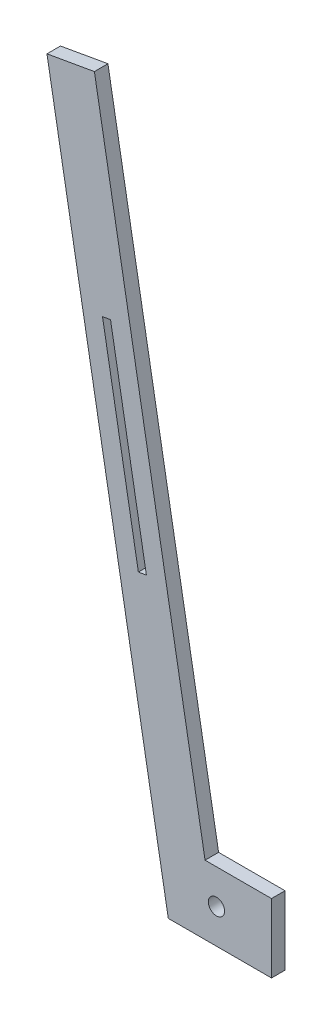
ISO-10303-21;
HEADER;
FILE_DESCRIPTION(('STEP AP214'),'2;1');
FILE_NAME('part.step','',(''),(''),'','','');
FILE_SCHEMA(('AUTOMOTIVE_DESIGN { 1 0 10303 214 1 1 1 1 }'));
ENDSEC;
DATA;
#1=APPLICATION_CONTEXT('core data for automotive mechanical design processes');
#2=APPLICATION_PROTOCOL_DEFINITION('international standard','automotive_design',2000,#1);
#3=PRODUCT_CONTEXT('',#1,'mechanical');
#4=PRODUCT('Part','Part','',(#3));
#5=PRODUCT_RELATED_PRODUCT_CATEGORY('part','',(#4));
#6=PRODUCT_DEFINITION_FORMATION('','',#4);
#7=PRODUCT_DEFINITION_CONTEXT('part definition',#1,'design');
#8=PRODUCT_DEFINITION('design','',#6,#7);
#9=PRODUCT_DEFINITION_SHAPE('','',#8);
#10=(LENGTH_UNIT() NAMED_UNIT(*) SI_UNIT(.MILLI.,.METRE.));
#11=(NAMED_UNIT(*) PLANE_ANGLE_UNIT() SI_UNIT($,.RADIAN.));
#12=(NAMED_UNIT(*) SI_UNIT($,.STERADIAN.) SOLID_ANGLE_UNIT());
#13=UNCERTAINTY_MEASURE_WITH_UNIT(LENGTH_MEASURE(1.E-05),#10,'distance_accuracy_value','');
#14=(GEOMETRIC_REPRESENTATION_CONTEXT(3) GLOBAL_UNCERTAINTY_ASSIGNED_CONTEXT((#13)) GLOBAL_UNIT_ASSIGNED_CONTEXT((#10,
#11,#12)) REPRESENTATION_CONTEXT('',''));
#15=CARTESIAN_POINT('',(0.,0.,0.));
#16=DIRECTION('',(0.,0.,1.));
#17=DIRECTION('',(1.,0.,0.));
#18=AXIS2_PLACEMENT_3D('',#15,#16,#17);
#19=CARTESIAN_POINT('',(0.,0.,2.5));
#20=DIRECTION('',(0.,0.,1.));
#21=DIRECTION('',(1.,0.,0.));
#22=AXIS2_PLACEMENT_3D('',#19,#20,#21);
#23=PLANE('',#22);
#24=DIRECTION('',(0.173648177666934,-0.984807753012208,0.));
#25=VECTOR('',#24,1.);
#26=CARTESIAN_POINT('',(-12.1379660141445,-2.14025089921611,2.5));
#27=LINE('',#26,#25);
#28=CARTESIAN_POINT('',(-42.0573326669705,167.540909253428,2.5));
#29=VERTEX_POINT('',#28);
#30=CARTESIAN_POINT('',(-28.8253415287501,92.4985584738982,2.5));
#31=VERTEX_POINT('',#30);
#32=EDGE_CURVE('E118',#29,#31,#27,.T.);
#33=ORIENTED_EDGE('',*,*,#32,.F.);
#34=DIRECTION('',(-0.984807753012207,-0.173648177666936,0.));
#35=VECTOR('',#34,1.);
#36=CARTESIAN_POINT('',(-29.9193666528262,169.681160152645,2.5));
#37=LINE('',#36,#35);
#38=CARTESIAN_POINT('',(-39.1029094079339,168.061853786429,2.5));
#39=VERTEX_POINT('',#38);
#40=EDGE_CURVE('E178',#39,#29,#37,.T.);
#41=ORIENTED_EDGE('',*,*,#40,.F.);
#42=DIRECTION('',(-0.173648177666934,0.984807753012208,0.));
#43=VECTOR('',#42,1.);
#44=CARTESIAN_POINT('',(-9.18354275510789,-1.61930636621531,2.5));
#45=LINE('',#44,#43);
#46=CARTESIAN_POINT('',(-25.8709182697135,93.019503006899,2.5));
#47=VERTEX_POINT('',#46);
#48=EDGE_CURVE('E180',#47,#39,#45,.T.);
#49=ORIENTED_EDGE('',*,*,#48,.F.);
#50=DIRECTION('',(0.984807753012207,0.173648177666936,0.));
#51=VECTOR('',#50,1.);
#52=CARTESIAN_POINT('',(-16.6873755146058,94.6388093731143,2.5));
#53=LINE('',#52,#51);
#54=EDGE_CURVE('E182',#31,#47,#53,.T.);
#55=ORIENTED_EDGE('',*,*,#54,.F.);
#56=EDGE_LOOP('',(#33,#41,#49,#55));
#57=FACE_BOUND('',#56,.T.);
#58=DIRECTION('',(-1.,0.,0.));
#59=VECTOR('',#58,1.);
#60=CARTESIAN_POINT('',(20.32,12.7,2.5));
#61=LINE('',#60,#59);
#62=CARTESIAN_POINT('',(20.32,12.7,2.5));
#63=VERTEX_POINT('',#62);
#64=CARTESIAN_POINT('',(-4.20442015066628,12.7,2.5));
#65=VERTEX_POINT('',#64);
#66=EDGE_CURVE('E143',#63,#65,#61,.T.);
#67=ORIENTED_EDGE('',*,*,#66,.T.);
#68=DIRECTION('',(0.173648177666935,-0.984807753012207,0.));
#69=VECTOR('',#68,1.);
#70=CARTESIAN_POINT('',(-4.20442015066628,12.7,2.5));
#71=LINE('',#70,#69);
#72=CARTESIAN_POINT('',(-45.057171251394,244.387464598918,2.5));
#73=VERTEX_POINT('',#72);
#74=EDGE_CURVE('E172',#73,#65,#71,.T.);
#75=ORIENTED_EDGE('',*,*,#74,.F.);
#76=DIRECTION('',(-0.984807753012207,-0.173648177666934,0.));
#77=VECTOR('',#76,1.);
#78=CARTESIAN_POINT('',(-62.5670530999511,241.3,2.5));
#79=LINE('',#78,#77);
#80=CARTESIAN_POINT('',(-62.5670530999511,241.3,2.5));
#81=VERTEX_POINT('',#80);
#82=EDGE_CURVE('E158',#73,#81,#79,.T.);
#83=ORIENTED_EDGE('',*,*,#82,.T.);
#84=DIRECTION('',(0.173648177666934,-0.984807753012207,0.));
#85=VECTOR('',#84,1.);
#86=CARTESIAN_POINT('',(-17.78,-12.7,2.5));
#87=LINE('',#86,#85);
#88=CARTESIAN_POINT('',(-17.78,-12.7,2.5));
#89=VERTEX_POINT('',#88);
#90=EDGE_CURVE('E156',#81,#89,#87,.T.);
#91=ORIENTED_EDGE('',*,*,#90,.T.);
#92=DIRECTION('',(1.,0.,0.));
#93=VECTOR('',#92,1.);
#94=CARTESIAN_POINT('',(20.32,-12.7,2.5));
#95=LINE('',#94,#93);
#96=CARTESIAN_POINT('',(20.32,-12.7,2.5));
#97=VERTEX_POINT('',#96);
#98=EDGE_CURVE('E154',#89,#97,#95,.T.);
#99=ORIENTED_EDGE('',*,*,#98,.T.);
#100=DIRECTION('',(0.,1.,0.));
#101=VECTOR('',#100,1.);
#102=CARTESIAN_POINT('',(20.32,12.7,2.5));
#103=LINE('',#102,#101);
#104=EDGE_CURVE('E140',#97,#63,#103,.T.);
#105=ORIENTED_EDGE('',*,*,#104,.T.);
#106=EDGE_LOOP('',(#67,#75,#83,#91,#99,#105));
#107=FACE_BOUND('',#106,.T.);
#108=CARTESIAN_POINT('',(0.,0.,2.5));
#109=DIRECTION('',(0.,0.,1.));
#110=DIRECTION('',(1.,0.,0.));
#111=AXIS2_PLACEMENT_3D('',#108,#109,#110);
#112=CIRCLE('',#111,3.);
#113=CARTESIAN_POINT('',(3.,0.,2.5));
#114=VERTEX_POINT('',#113);
#115=EDGE_CURVE('E152',#114,#114,#112,.T.);
#116=ORIENTED_EDGE('',*,*,#115,.F.);
#117=EDGE_LOOP('',(#116));
#118=FACE_BOUND('',#117,.T.);
#119=ADVANCED_FACE('F32',(#57,#107,#118),#23,.T.);
#120=CARTESIAN_POINT('',(0.,0.,-2.5));
#121=DIRECTION('',(0.,0.,1.));
#122=DIRECTION('',(1.,0.,0.));
#123=AXIS2_PLACEMENT_3D('',#120,#121,#122);
#124=PLANE('',#123);
#125=DIRECTION('',(-0.984807753012207,-0.173648177666936,0.));
#126=VECTOR('',#125,1.);
#127=CARTESIAN_POINT('',(-29.9193666528262,169.681160152645,-2.5));
#128=LINE('',#127,#126);
#129=CARTESIAN_POINT('',(-39.1029094079339,168.061853786429,-2.5));
#130=VERTEX_POINT('',#129);
#131=CARTESIAN_POINT('',(-42.0573326669705,167.540909253428,-2.5));
#132=VERTEX_POINT('',#131);
#133=EDGE_CURVE('E40',#130,#132,#128,.T.);
#134=ORIENTED_EDGE('',*,*,#133,.T.);
#135=DIRECTION('',(0.173648177666934,-0.984807753012208,0.));
#136=VECTOR('',#135,1.);
#137=CARTESIAN_POINT('',(-12.1379660141445,-2.14025089921611,-2.5));
#138=LINE('',#137,#136);
#139=CARTESIAN_POINT('',(-28.8253415287501,92.4985584738982,-2.5));
#140=VERTEX_POINT('',#139);
#141=EDGE_CURVE('E11',#132,#140,#138,.T.);
#142=ORIENTED_EDGE('',*,*,#141,.T.);
#143=DIRECTION('',(0.984807753012207,0.173648177666936,0.));
#144=VECTOR('',#143,1.);
#145=CARTESIAN_POINT('',(-16.6873755146058,94.6388093731143,-2.5));
#146=LINE('',#145,#144);
#147=CARTESIAN_POINT('',(-25.8709182697135,93.019503006899,-2.5));
#148=VERTEX_POINT('',#147);
#149=EDGE_CURVE('E106',#140,#148,#146,.T.);
#150=ORIENTED_EDGE('',*,*,#149,.T.);
#151=DIRECTION('',(-0.173648177666934,0.984807753012208,0.));
#152=VECTOR('',#151,1.);
#153=CARTESIAN_POINT('',(-9.18354275510789,-1.61930636621531,-2.5));
#154=LINE('',#153,#152);
#155=EDGE_CURVE('E110',#148,#130,#154,.T.);
#156=ORIENTED_EDGE('',*,*,#155,.T.);
#157=EDGE_LOOP('',(#134,#142,#150,#156));
#158=FACE_BOUND('',#157,.T.);
#159=DIRECTION('',(0.173648177666935,-0.984807753012207,0.));
#160=VECTOR('',#159,1.);
#161=CARTESIAN_POINT('',(-4.20442015066628,12.7,-2.5));
#162=LINE('',#161,#160);
#163=CARTESIAN_POINT('',(-45.057171251394,244.387464598918,-2.5));
#164=VERTEX_POINT('',#163);
#165=CARTESIAN_POINT('',(-4.20442015066628,12.7,-2.5));
#166=VERTEX_POINT('',#165);
#167=EDGE_CURVE('E169',#164,#166,#162,.T.);
#168=ORIENTED_EDGE('',*,*,#167,.T.);
#169=DIRECTION('',(-1.,0.,0.));
#170=VECTOR('',#169,1.);
#171=CARTESIAN_POINT('',(20.32,12.7,-2.5));
#172=LINE('',#171,#170);
#173=CARTESIAN_POINT('',(20.32,12.7,-2.5));
#174=VERTEX_POINT('',#173);
#175=EDGE_CURVE('E150',#174,#166,#172,.T.);
#176=ORIENTED_EDGE('',*,*,#175,.F.);
#177=DIRECTION('',(0.,1.,0.));
#178=VECTOR('',#177,1.);
#179=CARTESIAN_POINT('',(20.32,12.7,-2.5));
#180=LINE('',#179,#178);
#181=CARTESIAN_POINT('',(20.32,-12.7,-2.5));
#182=VERTEX_POINT('',#181);
#183=EDGE_CURVE('E141',#182,#174,#180,.T.);
#184=ORIENTED_EDGE('',*,*,#183,.F.);
#185=DIRECTION('',(1.,0.,0.));
#186=VECTOR('',#185,1.);
#187=CARTESIAN_POINT('',(20.32,-12.7,-2.5));
#188=LINE('',#187,#186);
#189=CARTESIAN_POINT('',(-17.78,-12.7,-2.5));
#190=VERTEX_POINT('',#189);
#191=EDGE_CURVE('E144',#190,#182,#188,.T.);
#192=ORIENTED_EDGE('',*,*,#191,.F.);
#193=DIRECTION('',(0.173648177666934,-0.984807753012207,0.));
#194=VECTOR('',#193,1.);
#195=CARTESIAN_POINT('',(-17.78,-12.7,-2.5));
#196=LINE('',#195,#194);
#197=CARTESIAN_POINT('',(-62.5670530999511,241.3,-2.5));
#198=VERTEX_POINT('',#197);
#199=EDGE_CURVE('E146',#198,#190,#196,.T.);
#200=ORIENTED_EDGE('',*,*,#199,.F.);
#201=DIRECTION('',(-0.984807753012207,-0.173648177666934,0.));
#202=VECTOR('',#201,1.);
#203=CARTESIAN_POINT('',(-62.5670530999511,241.3,-2.5));
#204=LINE('',#203,#202);
#205=EDGE_CURVE('E148',#164,#198,#204,.T.);
#206=ORIENTED_EDGE('',*,*,#205,.F.);
#207=EDGE_LOOP('',(#168,#176,#184,#192,#200,#206));
#208=FACE_BOUND('',#207,.T.);
#209=CARTESIAN_POINT('',(0.,0.,-2.5));
#210=DIRECTION('',(0.,0.,1.));
#211=DIRECTION('',(1.,0.,0.));
#212=AXIS2_PLACEMENT_3D('',#209,#210,#211);
#213=CIRCLE('',#212,3.);
#214=CARTESIAN_POINT('',(3.,0.,-2.5));
#215=VERTEX_POINT('',#214);
#216=EDGE_CURVE('E161',#215,#215,#213,.T.);
#217=ORIENTED_EDGE('',*,*,#216,.T.);
#218=EDGE_LOOP('',(#217));
#219=FACE_BOUND('',#218,.T.);
#220=ADVANCED_FACE('F122',(#158,#208,#219),#124,.F.);
#221=CARTESIAN_POINT('',(20.32,12.7,2.5));
#222=DIRECTION('',(0.,-1.,0.));
#223=DIRECTION('',(1.,0.,0.));
#224=AXIS2_PLACEMENT_3D('',#221,#222,#223);
#225=PLANE('',#224);
#226=ORIENTED_EDGE('',*,*,#175,.T.);
#227=DIRECTION('',(0.,0.,1.));
#228=VECTOR('',#227,1.);
#229=CARTESIAN_POINT('',(-4.20442015066628,12.7,-2.5));
#230=LINE('',#229,#228);
#231=EDGE_CURVE('E164',#166,#65,#230,.T.);
#232=ORIENTED_EDGE('',*,*,#231,.T.);
#233=ORIENTED_EDGE('',*,*,#66,.F.);
#234=DIRECTION('',(0.,0.,-1.));
#235=VECTOR('',#234,1.);
#236=CARTESIAN_POINT('',(20.32,12.7,2.5));
#237=LINE('',#236,#235);
#238=EDGE_CURVE('E137',#63,#174,#237,.T.);
#239=ORIENTED_EDGE('',*,*,#238,.T.);
#240=EDGE_LOOP('',(#226,#232,#233,#239));
#241=FACE_BOUND('',#240,.T.);
#242=ADVANCED_FACE('F34',(#241),#225,.F.);
#243=CARTESIAN_POINT('',(-62.5670530999511,241.3,2.5));
#244=DIRECTION('',(0.173648177666934,-0.984807753012207,0.));
#245=DIRECTION('',(0.984807753012207,0.173648177666934,0.));
#246=AXIS2_PLACEMENT_3D('',#243,#244,#245);
#247=PLANE('',#246);
#248=ORIENTED_EDGE('',*,*,#82,.F.);
#249=DIRECTION('',(0.,0.,1.));
#250=VECTOR('',#249,1.);
#251=CARTESIAN_POINT('',(-45.057171251394,244.387464598918,-2.5));
#252=LINE('',#251,#250);
#253=EDGE_CURVE('E167',#164,#73,#252,.T.);
#254=ORIENTED_EDGE('',*,*,#253,.F.);
#255=ORIENTED_EDGE('',*,*,#205,.T.);
#256=DIRECTION('',(0.,0.,-1.));
#257=VECTOR('',#256,1.);
#258=CARTESIAN_POINT('',(-62.5670530999511,241.3,2.5));
#259=LINE('',#258,#257);
#260=EDGE_CURVE('E111',#81,#198,#259,.T.);
#261=ORIENTED_EDGE('',*,*,#260,.F.);
#262=EDGE_LOOP('',(#248,#254,#255,#261));
#263=FACE_BOUND('',#262,.T.);
#264=ADVANCED_FACE('F224',(#263),#247,.F.);
#265=CARTESIAN_POINT('',(-17.78,-12.7,2.5));
#266=DIRECTION('',(0.984807753012207,0.173648177666934,0.));
#267=DIRECTION('',(-0.173648177666934,0.984807753012207,0.));
#268=AXIS2_PLACEMENT_3D('',#265,#266,#267);
#269=PLANE('',#268);
#270=ORIENTED_EDGE('',*,*,#199,.T.);
#271=DIRECTION('',(0.,0.,-1.));
#272=VECTOR('',#271,1.);
#273=CARTESIAN_POINT('',(-17.78,-12.7,2.5));
#274=LINE('',#273,#272);
#275=EDGE_CURVE('E131',#89,#190,#274,.T.);
#276=ORIENTED_EDGE('',*,*,#275,.F.);
#277=ORIENTED_EDGE('',*,*,#90,.F.);
#278=ORIENTED_EDGE('',*,*,#260,.T.);
#279=EDGE_LOOP('',(#270,#276,#277,#278));
#280=FACE_BOUND('',#279,.T.);
#281=ADVANCED_FACE('F221',(#280),#269,.F.);
#282=CARTESIAN_POINT('',(20.32,-12.7,2.5));
#283=DIRECTION('',(0.,1.,0.));
#284=DIRECTION('',(-1.,0.,0.));
#285=AXIS2_PLACEMENT_3D('',#282,#283,#284);
#286=PLANE('',#285);
#287=ORIENTED_EDGE('',*,*,#191,.T.);
#288=DIRECTION('',(0.,0.,-1.));
#289=VECTOR('',#288,1.);
#290=CARTESIAN_POINT('',(20.32,-12.7,2.5));
#291=LINE('',#290,#289);
#292=EDGE_CURVE('E134',#97,#182,#291,.T.);
#293=ORIENTED_EDGE('',*,*,#292,.F.);
#294=ORIENTED_EDGE('',*,*,#98,.F.);
#295=ORIENTED_EDGE('',*,*,#275,.T.);
#296=EDGE_LOOP('',(#287,#293,#294,#295));
#297=FACE_BOUND('',#296,.T.);
#298=ADVANCED_FACE('F217',(#297),#286,.F.);
#299=CARTESIAN_POINT('',(20.32,12.7,2.5));
#300=DIRECTION('',(-1.,0.,0.));
#301=DIRECTION('',(0.,-1.,0.));
#302=AXIS2_PLACEMENT_3D('',#299,#300,#301);
#303=PLANE('',#302);
#304=ORIENTED_EDGE('',*,*,#183,.T.);
#305=ORIENTED_EDGE('',*,*,#238,.F.);
#306=ORIENTED_EDGE('',*,*,#104,.F.);
#307=ORIENTED_EDGE('',*,*,#292,.T.);
#308=EDGE_LOOP('',(#304,#305,#306,#307));
#309=FACE_BOUND('',#308,.T.);
#310=ADVANCED_FACE('F214',(#309),#303,.F.);
#311=CARTESIAN_POINT('',(0.,0.,2.5));
#312=DIRECTION('',(0.,0.,-1.));
#313=DIRECTION('',(-1.,0.,0.));
#314=AXIS2_PLACEMENT_3D('',#311,#312,#313);
#315=CYLINDRICAL_SURFACE('',#314,3.);
#316=ORIENTED_EDGE('',*,*,#115,.T.);
#317=EDGE_LOOP('',(#316));
#318=FACE_BOUND('',#317,.T.);
#319=ORIENTED_EDGE('',*,*,#216,.F.);
#320=EDGE_LOOP('',(#319));
#321=FACE_BOUND('',#320,.T.);
#322=ADVANCED_FACE('F211',(#318,#321),#315,.F.);
#323=CARTESIAN_POINT('',(-4.20442015066628,12.7,-2.5));
#324=DIRECTION('',(-0.984807753012207,-0.173648177666935,0.));
#325=DIRECTION('',(0.173648177666935,-0.984807753012207,0.));
#326=AXIS2_PLACEMENT_3D('',#323,#324,#325);
#327=PLANE('',#326);
#328=ORIENTED_EDGE('',*,*,#74,.T.);
#329=ORIENTED_EDGE('',*,*,#231,.F.);
#330=ORIENTED_EDGE('',*,*,#167,.F.);
#331=ORIENTED_EDGE('',*,*,#253,.T.);
#332=EDGE_LOOP('',(#328,#329,#330,#331));
#333=FACE_BOUND('',#332,.T.);
#334=ADVANCED_FACE('F202',(#333),#327,.F.);
#335=CARTESIAN_POINT('',(-42.0573326669705,167.540909253428,-25.4));
#336=DIRECTION('',(-0.984807753012207,-0.173648177666934,0.));
#337=DIRECTION('',(0.173648177666934,-0.984807753012208,0.));
#338=AXIS2_PLACEMENT_3D('',#335,#336,#337);
#339=PLANE('',#338);
#340=ORIENTED_EDGE('',*,*,#32,.T.);
#341=DIRECTION('',(0.,0.,1.));
#342=VECTOR('',#341,1.);
#343=CARTESIAN_POINT('',(-28.8253415287501,92.4985584738982,-25.4));
#344=LINE('',#343,#342);
#345=EDGE_CURVE('E47',#140,#31,#344,.T.);
#346=ORIENTED_EDGE('',*,*,#345,.F.);
#347=ORIENTED_EDGE('',*,*,#141,.F.);
#348=DIRECTION('',(0.,0.,1.));
#349=VECTOR('',#348,1.);
#350=CARTESIAN_POINT('',(-42.0573326669705,167.540909253428,-25.4));
#351=LINE('',#350,#349);
#352=EDGE_CURVE('E183',#132,#29,#351,.T.);
#353=ORIENTED_EDGE('',*,*,#352,.T.);
#354=EDGE_LOOP('',(#340,#346,#347,#353));
#355=FACE_BOUND('',#354,.T.);
#356=ADVANCED_FACE('F114',(#355),#339,.F.);
#357=CARTESIAN_POINT('',(-42.0573326669705,167.540909253428,-25.4));
#358=DIRECTION('',(-0.173648177666936,0.984807753012207,0.));
#359=DIRECTION('',(-0.984807753012207,-0.173648177666936,0.));
#360=AXIS2_PLACEMENT_3D('',#357,#358,#359);
#361=PLANE('',#360);
#362=ORIENTED_EDGE('',*,*,#40,.T.);
#363=ORIENTED_EDGE('',*,*,#352,.F.);
#364=ORIENTED_EDGE('',*,*,#133,.F.);
#365=DIRECTION('',(0.,0.,1.));
#366=VECTOR('',#365,1.);
#367=CARTESIAN_POINT('',(-39.1029094079339,168.061853786429,-25.4));
#368=LINE('',#367,#366);
#369=EDGE_CURVE('E186',#130,#39,#368,.T.);
#370=ORIENTED_EDGE('',*,*,#369,.T.);
#371=EDGE_LOOP('',(#362,#363,#364,#370));
#372=FACE_BOUND('',#371,.T.);
#373=ADVANCED_FACE('F194',(#372),#361,.F.);
#374=CARTESIAN_POINT('',(-39.1029094079339,168.061853786429,-25.4));
#375=DIRECTION('',(0.984807753012207,0.173648177666934,0.));
#376=DIRECTION('',(-0.173648177666934,0.984807753012208,0.));
#377=AXIS2_PLACEMENT_3D('',#374,#375,#376);
#378=PLANE('',#377);
#379=ORIENTED_EDGE('',*,*,#48,.T.);
#380=ORIENTED_EDGE('',*,*,#369,.F.);
#381=ORIENTED_EDGE('',*,*,#155,.F.);
#382=DIRECTION('',(0.,0.,1.));
#383=VECTOR('',#382,1.);
#384=CARTESIAN_POINT('',(-25.8709182697135,93.019503006899,-25.4));
#385=LINE('',#384,#383);
#386=EDGE_CURVE('E52',#148,#47,#385,.T.);
#387=ORIENTED_EDGE('',*,*,#386,.T.);
#388=EDGE_LOOP('',(#379,#380,#381,#387));
#389=FACE_BOUND('',#388,.T.);
#390=ADVANCED_FACE('F193',(#389),#378,.F.);
#391=CARTESIAN_POINT('',(-28.8253415287501,92.4985584738982,-25.4));
#392=DIRECTION('',(0.173648177666936,-0.984807753012207,0.));
#393=DIRECTION('',(0.984807753012207,0.173648177666936,0.));
#394=AXIS2_PLACEMENT_3D('',#391,#392,#393);
#395=PLANE('',#394);
#396=ORIENTED_EDGE('',*,*,#54,.T.);
#397=ORIENTED_EDGE('',*,*,#386,.F.);
#398=ORIENTED_EDGE('',*,*,#149,.F.);
#399=ORIENTED_EDGE('',*,*,#345,.T.);
#400=EDGE_LOOP('',(#396,#397,#398,#399));
#401=FACE_BOUND('',#400,.T.);
#402=ADVANCED_FACE('F107',(#401),#395,.F.);
#403=CLOSED_SHELL('',(#119,#220,#242,#264,#281,#298,#310,#322,#334,#356,#373,#390,#402));
#404=MANIFOLD_SOLID_BREP('B2',#403);
#405=ADVANCED_BREP_SHAPE_REPRESENTATION('',(#18,#404),#14);
#406=SHAPE_DEFINITION_REPRESENTATION(#9,#405);
ENDSEC;
END-ISO-10303-21;
